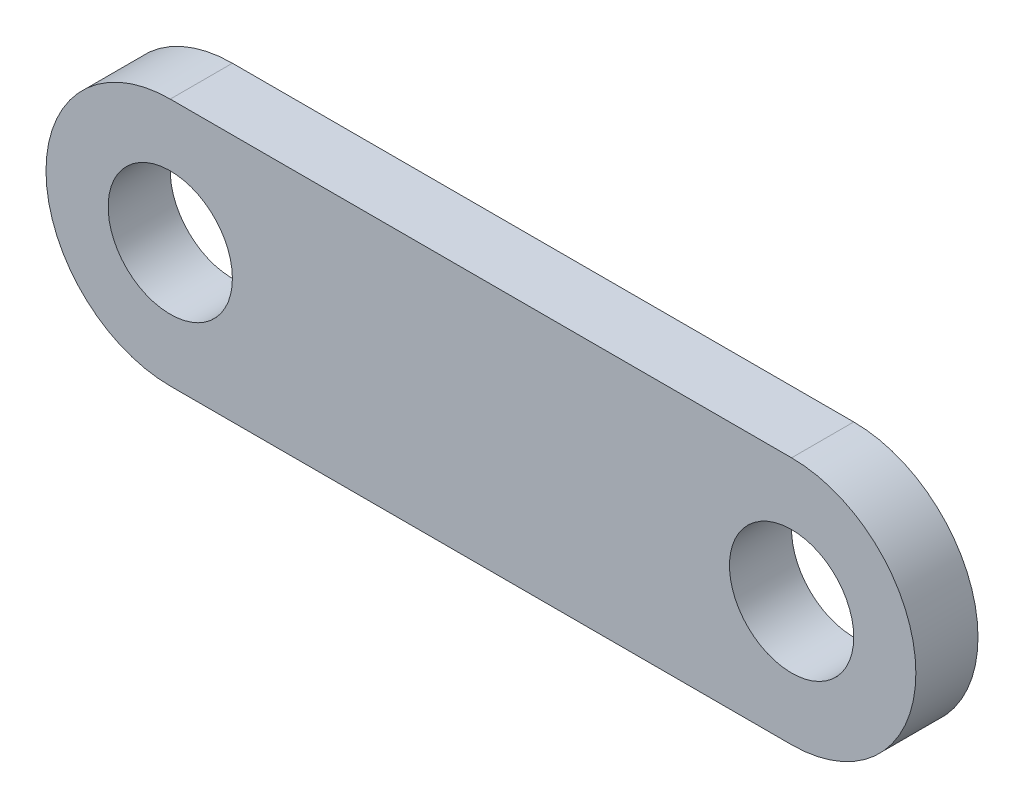
ISO-10303-21;
HEADER;
FILE_DESCRIPTION(('STEP AP214'),'2;1');
FILE_NAME('part.step','',(''),(''),'','','');
FILE_SCHEMA(('AUTOMOTIVE_DESIGN { 1 0 10303 214 1 1 1 1 }'));
ENDSEC;
DATA;
#1=APPLICATION_CONTEXT('core data for automotive mechanical design processes');
#2=APPLICATION_PROTOCOL_DEFINITION('international standard','automotive_design',2000,#1);
#3=PRODUCT_CONTEXT('',#1,'mechanical');
#4=PRODUCT('Part','Part','',(#3));
#5=PRODUCT_RELATED_PRODUCT_CATEGORY('part','',(#4));
#6=PRODUCT_DEFINITION_FORMATION('','',#4);
#7=PRODUCT_DEFINITION_CONTEXT('part definition',#1,'design');
#8=PRODUCT_DEFINITION('design','',#6,#7);
#9=PRODUCT_DEFINITION_SHAPE('','',#8);
#10=(LENGTH_UNIT() NAMED_UNIT(*) SI_UNIT(.MILLI.,.METRE.));
#11=(NAMED_UNIT(*) PLANE_ANGLE_UNIT() SI_UNIT($,.RADIAN.));
#12=(NAMED_UNIT(*) SI_UNIT($,.STERADIAN.) SOLID_ANGLE_UNIT());
#13=UNCERTAINTY_MEASURE_WITH_UNIT(LENGTH_MEASURE(1.E-05),#10,'distance_accuracy_value','');
#14=(GEOMETRIC_REPRESENTATION_CONTEXT(3) GLOBAL_UNCERTAINTY_ASSIGNED_CONTEXT((#13)) GLOBAL_UNIT_ASSIGNED_CONTEXT((#10,
#11,#12)) REPRESENTATION_CONTEXT('',''));
#15=CARTESIAN_POINT('',(0.,0.,0.));
#16=DIRECTION('',(0.,0.,1.));
#17=DIRECTION('',(1.,0.,0.));
#18=AXIS2_PLACEMENT_3D('',#15,#16,#17);
#19=CARTESIAN_POINT('',(0.,0.,2.54));
#20=DIRECTION('',(0.,0.,1.));
#21=DIRECTION('',(1.,0.,0.));
#22=AXIS2_PLACEMENT_3D('',#19,#20,#21);
#23=PLANE('',#22);
#24=CARTESIAN_POINT('',(-25.4,0.,2.54));
#25=DIRECTION('',(0.,0.,1.));
#26=DIRECTION('',(1.,0.,0.));
#27=AXIS2_PLACEMENT_3D('',#24,#25,#26);
#28=CIRCLE('',#27,2.54);
#29=CARTESIAN_POINT('',(-22.86,0.,2.54));
#30=VERTEX_POINT('',#29);
#31=EDGE_CURVE('E101',#30,#30,#28,.T.);
#32=ORIENTED_EDGE('',*,*,#31,.F.);
#33=EDGE_LOOP('',(#32));
#34=FACE_BOUND('',#33,.T.);
#35=CARTESIAN_POINT('',(0.,0.,2.54));
#36=DIRECTION('',(0.,0.,1.));
#37=DIRECTION('',(1.,0.,0.));
#38=AXIS2_PLACEMENT_3D('',#35,#36,#37);
#39=CIRCLE('',#38,5.08);
#40=CARTESIAN_POINT('',(0.,-5.08,2.54));
#41=VERTEX_POINT('',#40);
#42=CARTESIAN_POINT('',(0.,5.08,2.54));
#43=VERTEX_POINT('',#42);
#44=EDGE_CURVE('E86',#41,#43,#39,.T.);
#45=ORIENTED_EDGE('',*,*,#44,.T.);
#46=DIRECTION('',(-1.,0.,0.));
#47=VECTOR('',#46,1.);
#48=CARTESIAN_POINT('',(0.,5.08,2.54));
#49=LINE('',#48,#47);
#50=CARTESIAN_POINT('',(-25.4,5.08,2.54));
#51=VERTEX_POINT('',#50);
#52=EDGE_CURVE('E81',#43,#51,#49,.T.);
#53=ORIENTED_EDGE('',*,*,#52,.T.);
#54=CARTESIAN_POINT('',(-25.4,0.,2.54));
#55=DIRECTION('',(0.,0.,1.));
#56=DIRECTION('',(1.,0.,0.));
#57=AXIS2_PLACEMENT_3D('',#54,#55,#56);
#58=CIRCLE('',#57,5.08);
#59=CARTESIAN_POINT('',(-25.4,-5.08,2.54));
#60=VERTEX_POINT('',#59);
#61=EDGE_CURVE('E84',#51,#60,#58,.T.);
#62=ORIENTED_EDGE('',*,*,#61,.T.);
#63=DIRECTION('',(1.,0.,0.));
#64=VECTOR('',#63,1.);
#65=CARTESIAN_POINT('',(0.,-5.08,2.54));
#66=LINE('',#65,#64);
#67=EDGE_CURVE('E51',#60,#41,#66,.T.);
#68=ORIENTED_EDGE('',*,*,#67,.T.);
#69=EDGE_LOOP('',(#45,#53,#62,#68));
#70=FACE_BOUND('',#69,.T.);
#71=CARTESIAN_POINT('',(0.,0.,2.54));
#72=DIRECTION('',(0.,0.,1.));
#73=DIRECTION('',(1.,0.,0.));
#74=AXIS2_PLACEMENT_3D('',#71,#72,#73);
#75=CIRCLE('',#74,2.54);
#76=CARTESIAN_POINT('',(2.54,0.,2.54));
#77=VERTEX_POINT('',#76);
#78=EDGE_CURVE('E116',#77,#77,#75,.T.);
#79=ORIENTED_EDGE('',*,*,#78,.F.);
#80=EDGE_LOOP('',(#79));
#81=FACE_BOUND('',#80,.T.);
#82=ADVANCED_FACE('F34',(#34,#70,#81),#23,.T.);
#83=CARTESIAN_POINT('',(0.,0.,0.));
#84=DIRECTION('',(0.,0.,1.));
#85=DIRECTION('',(1.,0.,0.));
#86=AXIS2_PLACEMENT_3D('',#83,#84,#85);
#87=PLANE('',#86);
#88=CARTESIAN_POINT('',(0.,0.,0.));
#89=DIRECTION('',(0.,0.,1.));
#90=DIRECTION('',(1.,0.,0.));
#91=AXIS2_PLACEMENT_3D('',#88,#89,#90);
#92=CIRCLE('',#91,5.08);
#93=CARTESIAN_POINT('',(0.,-5.08,0.));
#94=VERTEX_POINT('',#93);
#95=CARTESIAN_POINT('',(0.,5.08,0.));
#96=VERTEX_POINT('',#95);
#97=EDGE_CURVE('E98',#94,#96,#92,.T.);
#98=ORIENTED_EDGE('',*,*,#97,.F.);
#99=DIRECTION('',(1.,0.,0.));
#100=VECTOR('',#99,1.);
#101=CARTESIAN_POINT('',(0.,-5.08,0.));
#102=LINE('',#101,#100);
#103=CARTESIAN_POINT('',(-25.4,-5.08,0.));
#104=VERTEX_POINT('',#103);
#105=EDGE_CURVE('E74',#104,#94,#102,.T.);
#106=ORIENTED_EDGE('',*,*,#105,.F.);
#107=CARTESIAN_POINT('',(-25.4,0.,0.));
#108=DIRECTION('',(0.,0.,1.));
#109=DIRECTION('',(1.,0.,0.));
#110=AXIS2_PLACEMENT_3D('',#107,#108,#109);
#111=CIRCLE('',#110,5.08);
#112=CARTESIAN_POINT('',(-25.4,5.08,0.));
#113=VERTEX_POINT('',#112);
#114=EDGE_CURVE('E68',#113,#104,#111,.T.);
#115=ORIENTED_EDGE('',*,*,#114,.F.);
#116=DIRECTION('',(-1.,0.,0.));
#117=VECTOR('',#116,1.);
#118=CARTESIAN_POINT('',(0.,5.08,0.));
#119=LINE('',#118,#117);
#120=EDGE_CURVE('E90',#96,#113,#119,.T.);
#121=ORIENTED_EDGE('',*,*,#120,.F.);
#122=EDGE_LOOP('',(#98,#106,#115,#121));
#123=FACE_BOUND('',#122,.T.);
#124=CARTESIAN_POINT('',(-25.4,0.,0.));
#125=DIRECTION('',(0.,0.,1.));
#126=DIRECTION('',(1.,0.,0.));
#127=AXIS2_PLACEMENT_3D('',#124,#125,#126);
#128=CIRCLE('',#127,2.54);
#129=CARTESIAN_POINT('',(-22.86,0.,0.));
#130=VERTEX_POINT('',#129);
#131=EDGE_CURVE('E113',#130,#130,#128,.T.);
#132=ORIENTED_EDGE('',*,*,#131,.T.);
#133=EDGE_LOOP('',(#132));
#134=FACE_BOUND('',#133,.T.);
#135=CARTESIAN_POINT('',(0.,0.,0.));
#136=DIRECTION('',(0.,0.,1.));
#137=DIRECTION('',(1.,0.,0.));
#138=AXIS2_PLACEMENT_3D('',#135,#136,#137);
#139=CIRCLE('',#138,2.54);
#140=CARTESIAN_POINT('',(2.54,0.,0.));
#141=VERTEX_POINT('',#140);
#142=EDGE_CURVE('E119',#141,#141,#139,.T.);
#143=ORIENTED_EDGE('',*,*,#142,.T.);
#144=EDGE_LOOP('',(#143));
#145=FACE_BOUND('',#144,.T.);
#146=ADVANCED_FACE('F109',(#123,#134,#145),#87,.F.);
#147=CARTESIAN_POINT('',(0.,0.,2.54));
#148=DIRECTION('',(0.,0.,-1.));
#149=DIRECTION('',(-1.,0.,0.));
#150=AXIS2_PLACEMENT_3D('',#147,#148,#149);
#151=CYLINDRICAL_SURFACE('',#150,5.08);
#152=ORIENTED_EDGE('',*,*,#97,.T.);
#153=DIRECTION('',(0.,0.,-1.));
#154=VECTOR('',#153,1.);
#155=CARTESIAN_POINT('',(0.,5.08,2.54));
#156=LINE('',#155,#154);
#157=EDGE_CURVE('E11',#43,#96,#156,.T.);
#158=ORIENTED_EDGE('',*,*,#157,.F.);
#159=ORIENTED_EDGE('',*,*,#44,.F.);
#160=DIRECTION('',(0.,0.,-1.));
#161=VECTOR('',#160,1.);
#162=CARTESIAN_POINT('',(0.,-5.08,2.54));
#163=LINE('',#162,#161);
#164=EDGE_CURVE('E94',#41,#94,#163,.T.);
#165=ORIENTED_EDGE('',*,*,#164,.T.);
#166=EDGE_LOOP('',(#152,#158,#159,#165));
#167=FACE_BOUND('',#166,.T.);
#168=ADVANCED_FACE('F36',(#167),#151,.T.);
#169=CARTESIAN_POINT('',(0.,5.08,2.54));
#170=DIRECTION('',(0.,-1.,0.));
#171=DIRECTION('',(1.,0.,0.));
#172=AXIS2_PLACEMENT_3D('',#169,#170,#171);
#173=PLANE('',#172);
#174=ORIENTED_EDGE('',*,*,#120,.T.);
#175=DIRECTION('',(0.,0.,-1.));
#176=VECTOR('',#175,1.);
#177=CARTESIAN_POINT('',(-25.4,5.08,2.54));
#178=LINE('',#177,#176);
#179=EDGE_CURVE('E43',#51,#113,#178,.T.);
#180=ORIENTED_EDGE('',*,*,#179,.F.);
#181=ORIENTED_EDGE('',*,*,#52,.F.);
#182=ORIENTED_EDGE('',*,*,#157,.T.);
#183=EDGE_LOOP('',(#174,#180,#181,#182));
#184=FACE_BOUND('',#183,.T.);
#185=ADVANCED_FACE('F89',(#184),#173,.F.);
#186=CARTESIAN_POINT('',(-25.4,0.,2.54));
#187=DIRECTION('',(0.,0.,-1.));
#188=DIRECTION('',(-1.,0.,0.));
#189=AXIS2_PLACEMENT_3D('',#186,#187,#188);
#190=CYLINDRICAL_SURFACE('',#189,5.08);
#191=ORIENTED_EDGE('',*,*,#114,.T.);
#192=DIRECTION('',(0.,0.,-1.));
#193=VECTOR('',#192,1.);
#194=CARTESIAN_POINT('',(-25.4,-5.08,2.54));
#195=LINE('',#194,#193);
#196=EDGE_CURVE('E91',#60,#104,#195,.T.);
#197=ORIENTED_EDGE('',*,*,#196,.F.);
#198=ORIENTED_EDGE('',*,*,#61,.F.);
#199=ORIENTED_EDGE('',*,*,#179,.T.);
#200=EDGE_LOOP('',(#191,#197,#198,#199));
#201=FACE_BOUND('',#200,.T.);
#202=ADVANCED_FACE('F92',(#201),#190,.T.);
#203=CARTESIAN_POINT('',(0.,-5.08,2.54));
#204=DIRECTION('',(0.,1.,0.));
#205=DIRECTION('',(-1.,0.,0.));
#206=AXIS2_PLACEMENT_3D('',#203,#204,#205);
#207=PLANE('',#206);
#208=ORIENTED_EDGE('',*,*,#105,.T.);
#209=ORIENTED_EDGE('',*,*,#164,.F.);
#210=ORIENTED_EDGE('',*,*,#67,.F.);
#211=ORIENTED_EDGE('',*,*,#196,.T.);
#212=EDGE_LOOP('',(#208,#209,#210,#211));
#213=FACE_BOUND('',#212,.T.);
#214=ADVANCED_FACE('F106',(#213),#207,.F.);
#215=CARTESIAN_POINT('',(-25.4,0.,2.54));
#216=DIRECTION('',(0.,0.,-1.));
#217=DIRECTION('',(-1.,0.,0.));
#218=AXIS2_PLACEMENT_3D('',#215,#216,#217);
#219=CYLINDRICAL_SURFACE('',#218,2.54);
#220=ORIENTED_EDGE('',*,*,#31,.T.);
#221=EDGE_LOOP('',(#220));
#222=FACE_BOUND('',#221,.T.);
#223=ORIENTED_EDGE('',*,*,#131,.F.);
#224=EDGE_LOOP('',(#223));
#225=FACE_BOUND('',#224,.T.);
#226=ADVANCED_FACE('F136',(#222,#225),#219,.F.);
#227=CARTESIAN_POINT('',(0.,0.,2.54));
#228=DIRECTION('',(0.,0.,-1.));
#229=DIRECTION('',(-1.,0.,0.));
#230=AXIS2_PLACEMENT_3D('',#227,#228,#229);
#231=CYLINDRICAL_SURFACE('',#230,2.54);
#232=ORIENTED_EDGE('',*,*,#78,.T.);
#233=EDGE_LOOP('',(#232));
#234=FACE_BOUND('',#233,.T.);
#235=ORIENTED_EDGE('',*,*,#142,.F.);
#236=EDGE_LOOP('',(#235));
#237=FACE_BOUND('',#236,.T.);
#238=ADVANCED_FACE('F125',(#234,#237),#231,.F.);
#239=CLOSED_SHELL('',(#82,#146,#168,#185,#202,#214,#226,#238));
#240=MANIFOLD_SOLID_BREP('B2',#239);
#241=ADVANCED_BREP_SHAPE_REPRESENTATION('',(#18,#240),#14);
#242=SHAPE_DEFINITION_REPRESENTATION(#9,#241);
ENDSEC;
END-ISO-10303-21;
